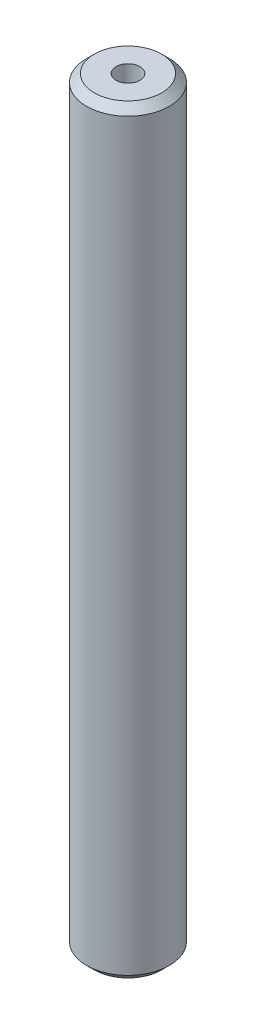
ISO-10303-21;
HEADER;
FILE_DESCRIPTION(('STEP AP214'),'2;1');
FILE_NAME('part.step','',(''),(''),'','','');
FILE_SCHEMA(('AUTOMOTIVE_DESIGN { 1 0 10303 214 1 1 1 1 }'));
ENDSEC;
DATA;
#1=APPLICATION_CONTEXT('core data for automotive mechanical design processes');
#2=APPLICATION_PROTOCOL_DEFINITION('international standard','automotive_design',2000,#1);
#3=PRODUCT_CONTEXT('',#1,'mechanical');
#4=PRODUCT('Part','Part','',(#3));
#5=PRODUCT_RELATED_PRODUCT_CATEGORY('part','',(#4));
#6=PRODUCT_DEFINITION_FORMATION('','',#4);
#7=PRODUCT_DEFINITION_CONTEXT('part definition',#1,'design');
#8=PRODUCT_DEFINITION('design','',#6,#7);
#9=PRODUCT_DEFINITION_SHAPE('','',#8);
#10=(LENGTH_UNIT() NAMED_UNIT(*) SI_UNIT(.MILLI.,.METRE.));
#11=(NAMED_UNIT(*) PLANE_ANGLE_UNIT() SI_UNIT($,.RADIAN.));
#12=(NAMED_UNIT(*) SI_UNIT($,.STERADIAN.) SOLID_ANGLE_UNIT());
#13=UNCERTAINTY_MEASURE_WITH_UNIT(LENGTH_MEASURE(1.E-05),#10,'distance_accuracy_value','');
#14=(GEOMETRIC_REPRESENTATION_CONTEXT(3) GLOBAL_UNCERTAINTY_ASSIGNED_CONTEXT((#13)) GLOBAL_UNIT_ASSIGNED_CONTEXT((#10,
#11,#12)) REPRESENTATION_CONTEXT('',''));
#15=CARTESIAN_POINT('',(0.,0.,0.));
#16=DIRECTION('',(0.,0.,1.));
#17=DIRECTION('',(1.,0.,0.));
#18=AXIS2_PLACEMENT_3D('',#15,#16,#17);
#19=CARTESIAN_POINT('',(0.,550.320533962222,0.));
#20=DIRECTION('',(0.,-1.,0.));
#21=DIRECTION('',(0.,0.,-1.));
#22=AXIS2_PLACEMENT_3D('',#19,#20,#21);
#23=CYLINDRICAL_SURFACE('',#22,30.);
#24=CARTESIAN_POINT('',(0.,544.704381445802,0.));
#25=DIRECTION('',(0.,1.,0.));
#26=DIRECTION('',(0.,0.,1.));
#27=AXIS2_PLACEMENT_3D('',#24,#25,#26);
#28=CIRCLE('',#27,30.);
#29=CARTESIAN_POINT('',(0.,544.704381445802,30.));
#30=VERTEX_POINT('',#29);
#31=EDGE_CURVE('E50',#30,#30,#28,.F.);
#32=ORIENTED_EDGE('',*,*,#31,.T.);
#33=EDGE_LOOP('',(#32));
#34=FACE_BOUND('',#33,.T.);
#35=CARTESIAN_POINT('',(0.,5.61615251642023,0.));
#36=DIRECTION('',(0.,1.,0.));
#37=DIRECTION('',(0.,0.,1.));
#38=AXIS2_PLACEMENT_3D('',#35,#36,#37);
#39=CIRCLE('',#38,30.);
#40=CARTESIAN_POINT('',(0.,5.61615251642023,30.));
#41=VERTEX_POINT('',#40);
#42=EDGE_CURVE('E51',#41,#41,#39,.T.);
#43=ORIENTED_EDGE('',*,*,#42,.T.);
#44=EDGE_LOOP('',(#43));
#45=FACE_BOUND('',#44,.T.);
#46=ADVANCED_FACE('F39',(#34,#45),#23,.T.);
#47=CARTESIAN_POINT('',(0.,550.320533962222,0.));
#48=DIRECTION('',(0.,1.,0.));
#49=DIRECTION('',(0.,0.,1.));
#50=AXIS2_PLACEMENT_3D('',#47,#48,#49);
#51=PLANE('',#50);
#52=CARTESIAN_POINT('',(0.,550.320533962222,0.));
#53=DIRECTION('',(0.,1.,0.));
#54=DIRECTION('',(0.,0.,1.));
#55=AXIS2_PLACEMENT_3D('',#52,#53,#54);
#56=CIRCLE('',#55,24.3838474835796);
#57=CARTESIAN_POINT('',(0.,550.320533962222,24.3838474835796));
#58=VERTEX_POINT('',#57);
#59=EDGE_CURVE('E54',#58,#58,#56,.T.);
#60=ORIENTED_EDGE('',*,*,#59,.T.);
#61=EDGE_LOOP('',(#60));
#62=FACE_BOUND('',#61,.T.);
#63=CARTESIAN_POINT('',(0.,550.320533962222,0.));
#64=DIRECTION('',(0.,1.,0.));
#65=DIRECTION('',(0.,0.,1.));
#66=AXIS2_PLACEMENT_3D('',#63,#64,#65);
#67=CIRCLE('',#66,8.63833787536998);
#68=CARTESIAN_POINT('',(0.,550.320533962222,8.63833787536998));
#69=VERTEX_POINT('',#68);
#70=EDGE_CURVE('E58',#69,#69,#67,.T.);
#71=ORIENTED_EDGE('',*,*,#70,.F.);
#72=EDGE_LOOP('',(#71));
#73=FACE_BOUND('',#72,.T.);
#74=ADVANCED_FACE('F69',(#62,#73),#51,.T.);
#75=CARTESIAN_POINT('',(0.,0.,0.));
#76=DIRECTION('',(0.,1.,0.));
#77=DIRECTION('',(0.,0.,1.));
#78=AXIS2_PLACEMENT_3D('',#75,#76,#77);
#79=PLANE('',#78);
#80=CARTESIAN_POINT('',(0.,0.,0.));
#81=DIRECTION('',(0.,1.,0.));
#82=DIRECTION('',(0.,0.,1.));
#83=AXIS2_PLACEMENT_3D('',#80,#81,#82);
#84=CIRCLE('',#83,24.3838474835797);
#85=CARTESIAN_POINT('',(0.,0.,24.3838474835797));
#86=VERTEX_POINT('',#85);
#87=EDGE_CURVE('E10',#86,#86,#84,.F.);
#88=ORIENTED_EDGE('',*,*,#87,.T.);
#89=EDGE_LOOP('',(#88));
#90=FACE_BOUND('',#89,.T.);
#91=CARTESIAN_POINT('',(0.,0.,0.));
#92=DIRECTION('',(0.,1.,0.));
#93=DIRECTION('',(0.,0.,1.));
#94=AXIS2_PLACEMENT_3D('',#91,#92,#93);
#95=CIRCLE('',#94,8.63833787536998);
#96=CARTESIAN_POINT('',(0.,0.,8.63833787536998));
#97=VERTEX_POINT('',#96);
#98=EDGE_CURVE('E63',#97,#97,#95,.T.);
#99=ORIENTED_EDGE('',*,*,#98,.T.);
#100=EDGE_LOOP('',(#99));
#101=FACE_BOUND('',#100,.T.);
#102=ADVANCED_FACE('F75',(#90,#101),#79,.F.);
#103=CARTESIAN_POINT('',(0.,550.320533962222,0.));
#104=DIRECTION('',(0.,-1.,0.));
#105=DIRECTION('',(0.,0.,-1.));
#106=AXIS2_PLACEMENT_3D('',#103,#104,#105);
#107=CYLINDRICAL_SURFACE('',#106,8.63833787536998);
#108=ORIENTED_EDGE('',*,*,#70,.T.);
#109=EDGE_LOOP('',(#108));
#110=FACE_BOUND('',#109,.T.);
#111=ORIENTED_EDGE('',*,*,#98,.F.);
#112=EDGE_LOOP('',(#111));
#113=FACE_BOUND('',#112,.T.);
#114=ADVANCED_FACE('F70',(#110,#113),#107,.F.);
#115=CARTESIAN_POINT('',(0.,550.320533962222,0.));
#116=DIRECTION('',(0.,-1.,0.));
#117=DIRECTION('',(0.,0.,-1.));
#118=AXIS2_PLACEMENT_3D('',#115,#116,#117);
#119=CONICAL_SURFACE('',#118,24.3838474835796,0.785398163397431);
#120=ORIENTED_EDGE('',*,*,#31,.F.);
#121=EDGE_LOOP('',(#120));
#122=FACE_BOUND('',#121,.T.);
#123=ORIENTED_EDGE('',*,*,#59,.F.);
#124=EDGE_LOOP('',(#123));
#125=FACE_BOUND('',#124,.T.);
#126=ADVANCED_FACE('F81',(#122,#125),#119,.T.);
#127=CARTESIAN_POINT('',(0.,5.61615251642023,0.));
#128=DIRECTION('',(0.,1.,0.));
#129=DIRECTION('',(0.,0.,1.));
#130=AXIS2_PLACEMENT_3D('',#127,#128,#129);
#131=CONICAL_SURFACE('',#130,30.,0.785398163397451);
#132=ORIENTED_EDGE('',*,*,#87,.F.);
#133=EDGE_LOOP('',(#132));
#134=FACE_BOUND('',#133,.T.);
#135=ORIENTED_EDGE('',*,*,#42,.F.);
#136=EDGE_LOOP('',(#135));
#137=FACE_BOUND('',#136,.T.);
#138=ADVANCED_FACE('F45',(#134,#137),#131,.T.);
#139=CLOSED_SHELL('',(#46,#74,#102,#114,#126,#138));
#140=MANIFOLD_SOLID_BREP('B2',#139);
#141=ADVANCED_BREP_SHAPE_REPRESENTATION('',(#18,#140),#14);
#142=SHAPE_DEFINITION_REPRESENTATION(#9,#141);
ENDSEC;
END-ISO-10303-21;
